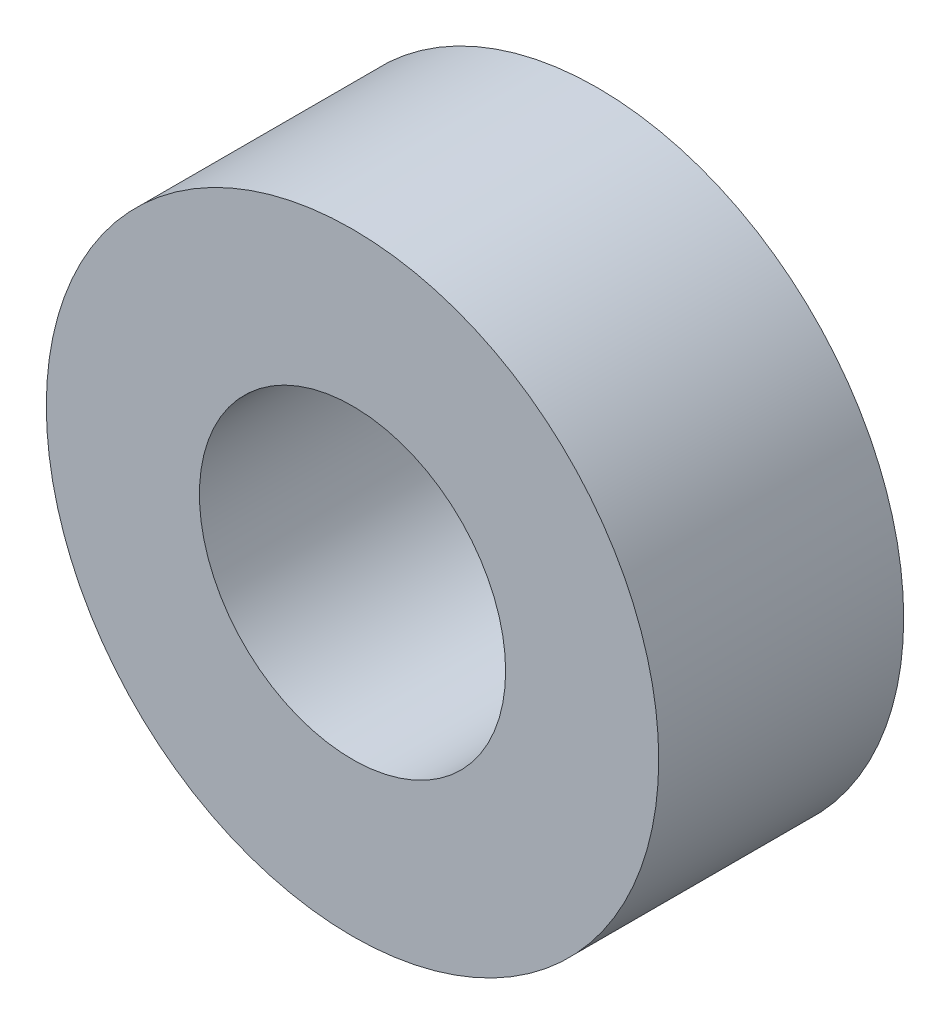
ISO-10303-21;
HEADER;
FILE_DESCRIPTION(('STEP AP214'),'2;1');
FILE_NAME('part.step','',(''),(''),'','','');
FILE_SCHEMA(('AUTOMOTIVE_DESIGN { 1 0 10303 214 1 1 1 1 }'));
ENDSEC;
DATA;
#1=APPLICATION_CONTEXT('core data for automotive mechanical design processes');
#2=APPLICATION_PROTOCOL_DEFINITION('international standard','automotive_design',2000,#1);
#3=PRODUCT_CONTEXT('',#1,'mechanical');
#4=PRODUCT('Part','Part','',(#3));
#5=PRODUCT_RELATED_PRODUCT_CATEGORY('part','',(#4));
#6=PRODUCT_DEFINITION_FORMATION('','',#4);
#7=PRODUCT_DEFINITION_CONTEXT('part definition',#1,'design');
#8=PRODUCT_DEFINITION('design','',#6,#7);
#9=PRODUCT_DEFINITION_SHAPE('','',#8);
#10=(LENGTH_UNIT() NAMED_UNIT(*) SI_UNIT(.MILLI.,.METRE.));
#11=(NAMED_UNIT(*) PLANE_ANGLE_UNIT() SI_UNIT($,.RADIAN.));
#12=(NAMED_UNIT(*) SI_UNIT($,.STERADIAN.) SOLID_ANGLE_UNIT());
#13=UNCERTAINTY_MEASURE_WITH_UNIT(LENGTH_MEASURE(1.E-05),#10,'distance_accuracy_value','');
#14=(GEOMETRIC_REPRESENTATION_CONTEXT(3) GLOBAL_UNCERTAINTY_ASSIGNED_CONTEXT((#13)) GLOBAL_UNIT_ASSIGNED_CONTEXT((#10,
#11,#12)) REPRESENTATION_CONTEXT('',''));
#15=CARTESIAN_POINT('',(0.,0.,0.));
#16=DIRECTION('',(0.,0.,1.));
#17=DIRECTION('',(1.,0.,0.));
#18=AXIS2_PLACEMENT_3D('',#15,#16,#17);
#19=CARTESIAN_POINT('',(0.,0.,-4.));
#20=DIRECTION('',(0.,0.,-1.));
#21=DIRECTION('',(1.,0.,0.));
#22=AXIS2_PLACEMENT_3D('',#19,#20,#21);
#23=PLANE('',#22);
#24=CARTESIAN_POINT('',(0.,0.,-4.));
#25=DIRECTION('',(0.,0.,1.));
#26=DIRECTION('',(1.,0.,0.));
#27=AXIS2_PLACEMENT_3D('',#24,#25,#26);
#28=CIRCLE('',#27,5.);
#29=CARTESIAN_POINT('',(5.,0.,-4.));
#30=VERTEX_POINT('',#29);
#31=EDGE_CURVE('E10',#30,#30,#28,.T.);
#32=ORIENTED_EDGE('',*,*,#31,.F.);
#33=EDGE_LOOP('',(#32));
#34=FACE_BOUND('',#33,.T.);
#35=CARTESIAN_POINT('',(0.,0.,-4.));
#36=DIRECTION('',(0.,0.,1.));
#37=DIRECTION('',(1.,0.,0.));
#38=AXIS2_PLACEMENT_3D('',#35,#36,#37);
#39=CIRCLE('',#38,2.5);
#40=CARTESIAN_POINT('',(2.5,0.,-4.));
#41=VERTEX_POINT('',#40);
#42=EDGE_CURVE('E52',#41,#41,#39,.T.);
#43=ORIENTED_EDGE('',*,*,#42,.T.);
#44=EDGE_LOOP('',(#43));
#45=FACE_BOUND('',#44,.T.);
#46=ADVANCED_FACE('F41',(#34,#45),#23,.T.);
#47=CARTESIAN_POINT('',(0.,0.,0.));
#48=DIRECTION('',(0.,0.,-1.));
#49=DIRECTION('',(1.,0.,0.));
#50=AXIS2_PLACEMENT_3D('',#47,#48,#49);
#51=PLANE('',#50);
#52=CARTESIAN_POINT('',(0.,0.,0.));
#53=DIRECTION('',(0.,0.,1.));
#54=DIRECTION('',(1.,0.,0.));
#55=AXIS2_PLACEMENT_3D('',#52,#53,#54);
#56=CIRCLE('',#55,5.);
#57=CARTESIAN_POINT('',(5.,0.,0.));
#58=VERTEX_POINT('',#57);
#59=EDGE_CURVE('E45',#58,#58,#56,.T.);
#60=ORIENTED_EDGE('',*,*,#59,.T.);
#61=EDGE_LOOP('',(#60));
#62=FACE_BOUND('',#61,.T.);
#63=CARTESIAN_POINT('',(0.,0.,0.));
#64=DIRECTION('',(0.,0.,1.));
#65=DIRECTION('',(1.,0.,0.));
#66=AXIS2_PLACEMENT_3D('',#63,#64,#65);
#67=CIRCLE('',#66,2.5);
#68=CARTESIAN_POINT('',(2.5,0.,0.));
#69=VERTEX_POINT('',#68);
#70=EDGE_CURVE('E54',#69,#69,#67,.T.);
#71=ORIENTED_EDGE('',*,*,#70,.F.);
#72=EDGE_LOOP('',(#71));
#73=FACE_BOUND('',#72,.T.);
#74=ADVANCED_FACE('F67',(#62,#73),#51,.F.);
#75=CARTESIAN_POINT('',(0.,0.,-4.));
#76=DIRECTION('',(0.,0.,1.));
#77=DIRECTION('',(-1.,0.,0.));
#78=AXIS2_PLACEMENT_3D('',#75,#76,#77);
#79=CYLINDRICAL_SURFACE('',#78,5.);
#80=ORIENTED_EDGE('',*,*,#31,.T.);
#81=EDGE_LOOP('',(#80));
#82=FACE_BOUND('',#81,.T.);
#83=ORIENTED_EDGE('',*,*,#59,.F.);
#84=EDGE_LOOP('',(#83));
#85=FACE_BOUND('',#84,.T.);
#86=ADVANCED_FACE('F43',(#82,#85),#79,.T.);
#87=CARTESIAN_POINT('',(0.,0.,-4.));
#88=DIRECTION('',(0.,0.,1.));
#89=DIRECTION('',(-1.,0.,0.));
#90=AXIS2_PLACEMENT_3D('',#87,#88,#89);
#91=CYLINDRICAL_SURFACE('',#90,2.5);
#92=ORIENTED_EDGE('',*,*,#42,.F.);
#93=EDGE_LOOP('',(#92));
#94=FACE_BOUND('',#93,.T.);
#95=ORIENTED_EDGE('',*,*,#70,.T.);
#96=EDGE_LOOP('',(#95));
#97=FACE_BOUND('',#96,.T.);
#98=ADVANCED_FACE('F61',(#94,#97),#91,.F.);
#99=CLOSED_SHELL('',(#46,#74,#86,#98));
#100=MANIFOLD_SOLID_BREP('B2',#99);
#101=ADVANCED_BREP_SHAPE_REPRESENTATION('',(#18,#100),#14);
#102=SHAPE_DEFINITION_REPRESENTATION(#9,#101);
ENDSEC;
END-ISO-10303-21;
